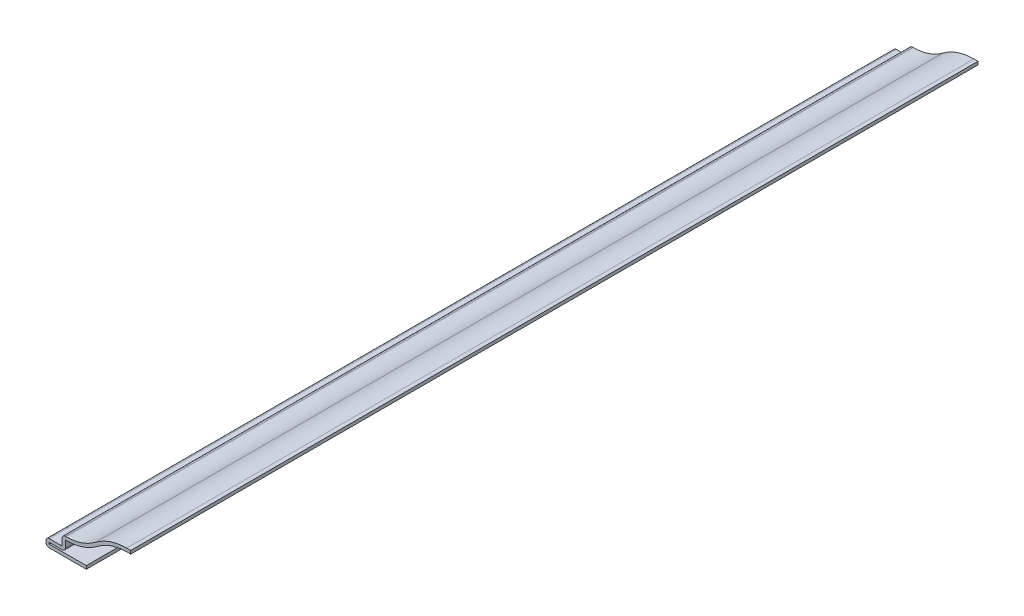
ISO-10303-21;
HEADER;
FILE_DESCRIPTION(('STEP AP214'),'2;1');
FILE_NAME('part.step','',(''),(''),'','','');
FILE_SCHEMA(('AUTOMOTIVE_DESIGN { 1 0 10303 214 1 1 1 1 }'));
ENDSEC;
DATA;
#1=APPLICATION_CONTEXT('core data for automotive mechanical design processes');
#2=APPLICATION_PROTOCOL_DEFINITION('international standard','automotive_design',2000,#1);
#3=PRODUCT_CONTEXT('',#1,'mechanical');
#4=PRODUCT('Part','Part','',(#3));
#5=PRODUCT_RELATED_PRODUCT_CATEGORY('part','',(#4));
#6=PRODUCT_DEFINITION_FORMATION('','',#4);
#7=PRODUCT_DEFINITION_CONTEXT('part definition',#1,'design');
#8=PRODUCT_DEFINITION('design','',#6,#7);
#9=PRODUCT_DEFINITION_SHAPE('','',#8);
#10=(LENGTH_UNIT() NAMED_UNIT(*) SI_UNIT(.MILLI.,.METRE.));
#11=(NAMED_UNIT(*) PLANE_ANGLE_UNIT() SI_UNIT($,.RADIAN.));
#12=(NAMED_UNIT(*) SI_UNIT($,.STERADIAN.) SOLID_ANGLE_UNIT());
#13=UNCERTAINTY_MEASURE_WITH_UNIT(LENGTH_MEASURE(1.E-05),#10,'distance_accuracy_value','');
#14=(GEOMETRIC_REPRESENTATION_CONTEXT(3) GLOBAL_UNCERTAINTY_ASSIGNED_CONTEXT((#13)) GLOBAL_UNIT_ASSIGNED_CONTEXT((#10,
#11,#12)) REPRESENTATION_CONTEXT('',''));
#15=CARTESIAN_POINT('',(0.,0.,0.));
#16=DIRECTION('',(0.,0.,1.));
#17=DIRECTION('',(1.,0.,0.));
#18=AXIS2_PLACEMENT_3D('',#15,#16,#17);
#19=CARTESIAN_POINT('',(-33.3375,0.,-333.375));
#20=DIRECTION('',(0.,-1.,0.));
#21=DIRECTION('',(1.,0.,0.));
#22=AXIS2_PLACEMENT_3D('',#19,#20,#21);
#23=PLANE('',#22);
#24=DIRECTION('',(1.,0.,0.));
#25=VECTOR('',#24,1.);
#26=CARTESIAN_POINT('',(-33.3375,0.,0.));
#27=LINE('',#26,#25);
#28=CARTESIAN_POINT('',(-32.0675,0.,0.));
#29=VERTEX_POINT('',#28);
#30=CARTESIAN_POINT('',(-17.4625,0.,0.));
#31=VERTEX_POINT('',#30);
#32=EDGE_CURVE('E315',#29,#31,#27,.T.);
#33=ORIENTED_EDGE('',*,*,#32,.F.);
#34=DIRECTION('',(0.,0.,1.));
#35=VECTOR('',#34,1.);
#36=CARTESIAN_POINT('',(-32.0675,0.,-333.375));
#37=LINE('',#36,#35);
#38=CARTESIAN_POINT('',(-32.0675,0.,-333.375));
#39=VERTEX_POINT('',#38);
#40=EDGE_CURVE('E191',#29,#39,#37,.F.);
#41=ORIENTED_EDGE('',*,*,#40,.T.);
#42=DIRECTION('',(1.,0.,0.));
#43=VECTOR('',#42,1.);
#44=CARTESIAN_POINT('',(-33.3375,0.,-333.375));
#45=LINE('',#44,#43);
#46=CARTESIAN_POINT('',(-17.4625,0.,-333.375));
#47=VERTEX_POINT('',#46);
#48=EDGE_CURVE('E184',#39,#47,#45,.T.);
#49=ORIENTED_EDGE('',*,*,#48,.T.);
#50=DIRECTION('',(0.,0.,1.));
#51=VECTOR('',#50,1.);
#52=CARTESIAN_POINT('',(-17.4625,0.,-333.375));
#53=LINE('',#52,#51);
#54=EDGE_CURVE('E188',#47,#31,#53,.T.);
#55=ORIENTED_EDGE('',*,*,#54,.T.);
#56=EDGE_LOOP('',(#33,#41,#49,#55));
#57=FACE_BOUND('',#56,.T.);
#58=ADVANCED_FACE('F35',(#57),#23,.T.);
#59=CARTESIAN_POINT('',(-33.3375,3.175,-333.375));
#60=DIRECTION('',(-1.,0.,0.));
#61=DIRECTION('',(0.,-1.,0.));
#62=AXIS2_PLACEMENT_3D('',#59,#60,#61);
#63=PLANE('',#62);
#64=DIRECTION('',(0.,-1.,0.));
#65=VECTOR('',#64,1.);
#66=CARTESIAN_POINT('',(-33.3375,3.175,-333.375));
#67=LINE('',#66,#65);
#68=CARTESIAN_POINT('',(-33.3375,1.905,-333.375));
#69=VERTEX_POINT('',#68);
#70=CARTESIAN_POINT('',(-33.3375,1.27,-333.375));
#71=VERTEX_POINT('',#70);
#72=EDGE_CURVE('E209',#69,#71,#67,.T.);
#73=ORIENTED_EDGE('',*,*,#72,.T.);
#74=DIRECTION('',(0.,0.,1.));
#75=VECTOR('',#74,1.);
#76=CARTESIAN_POINT('',(-33.3375,1.27,-333.375));
#77=LINE('',#76,#75);
#78=CARTESIAN_POINT('',(-33.3375,1.27,0.));
#79=VERTEX_POINT('',#78);
#80=EDGE_CURVE('E241',#71,#79,#77,.T.);
#81=ORIENTED_EDGE('',*,*,#80,.T.);
#82=DIRECTION('',(0.,-1.,0.));
#83=VECTOR('',#82,1.);
#84=CARTESIAN_POINT('',(-33.3375,3.175,0.));
#85=LINE('',#84,#83);
#86=CARTESIAN_POINT('',(-33.3375,1.905,0.));
#87=VERTEX_POINT('',#86);
#88=EDGE_CURVE('E194',#87,#79,#85,.T.);
#89=ORIENTED_EDGE('',*,*,#88,.F.);
#90=DIRECTION('',(0.,0.,1.));
#91=VECTOR('',#90,1.);
#92=CARTESIAN_POINT('',(-33.3375,1.905,-333.375));
#93=LINE('',#92,#91);
#94=EDGE_CURVE('E239',#87,#69,#93,.F.);
#95=ORIENTED_EDGE('',*,*,#94,.T.);
#96=EDGE_LOOP('',(#73,#81,#89,#95));
#97=FACE_BOUND('',#96,.T.);
#98=ADVANCED_FACE('F361',(#97),#63,.T.);
#99=CARTESIAN_POINT('',(-26.9875,3.175,-333.375));
#100=DIRECTION('',(0.,1.,0.));
#101=DIRECTION('',(-1.,0.,0.));
#102=AXIS2_PLACEMENT_3D('',#99,#100,#101);
#103=PLANE('',#102);
#104=DIRECTION('',(-1.,0.,0.));
#105=VECTOR('',#104,1.);
#106=CARTESIAN_POINT('',(-26.9875,3.175,-333.375));
#107=LINE('',#106,#105);
#108=CARTESIAN_POINT('',(-26.9875,3.175,-333.375));
#109=VERTEX_POINT('',#108);
#110=CARTESIAN_POINT('',(-32.0675,3.175,-333.375));
#111=VERTEX_POINT('',#110);
#112=EDGE_CURVE('E214',#109,#111,#107,.T.);
#113=ORIENTED_EDGE('',*,*,#112,.T.);
#114=DIRECTION('',(0.,0.,1.));
#115=VECTOR('',#114,1.);
#116=CARTESIAN_POINT('',(-32.0675,3.175,-333.375));
#117=LINE('',#116,#115);
#118=CARTESIAN_POINT('',(-32.0675,3.175,0.));
#119=VERTEX_POINT('',#118);
#120=EDGE_CURVE('E245',#111,#119,#117,.T.);
#121=ORIENTED_EDGE('',*,*,#120,.T.);
#122=DIRECTION('',(-1.,0.,0.));
#123=VECTOR('',#122,1.);
#124=CARTESIAN_POINT('',(-26.9875,3.175,0.));
#125=LINE('',#124,#123);
#126=CARTESIAN_POINT('',(-26.9875,3.175,0.));
#127=VERTEX_POINT('',#126);
#128=EDGE_CURVE('E265',#127,#119,#125,.T.);
#129=ORIENTED_EDGE('',*,*,#128,.F.);
#130=DIRECTION('',(0.,0.,1.));
#131=VECTOR('',#130,1.);
#132=CARTESIAN_POINT('',(-26.9875,3.175,-333.375));
#133=LINE('',#132,#131);
#134=EDGE_CURVE('E222',#109,#127,#133,.T.);
#135=ORIENTED_EDGE('',*,*,#134,.F.);
#136=EDGE_LOOP('',(#113,#121,#129,#135));
#137=FACE_BOUND('',#136,.T.);
#138=ADVANCED_FACE('F370',(#137),#103,.T.);
#139=CARTESIAN_POINT('',(-26.9875,7.12248880714343,-333.375));
#140=DIRECTION('',(-1.,0.,0.));
#141=DIRECTION('',(0.,0.,1.));
#142=AXIS2_PLACEMENT_3D('',#139,#140,#141);
#143=PLANE('',#142);
#144=DIRECTION('',(0.,-1.,0.));
#145=VECTOR('',#144,1.);
#146=CARTESIAN_POINT('',(-26.9875,7.12248880714343,0.));
#147=LINE('',#146,#145);
#148=CARTESIAN_POINT('',(-26.9875,5.85248880714343,0.));
#149=VERTEX_POINT('',#148);
#150=EDGE_CURVE('E263',#149,#127,#147,.T.);
#151=ORIENTED_EDGE('',*,*,#150,.F.);
#152=DIRECTION('',(0.,0.,1.));
#153=VECTOR('',#152,1.);
#154=CARTESIAN_POINT('',(-26.9875,5.85248880714343,-333.375));
#155=LINE('',#154,#153);
#156=CARTESIAN_POINT('',(-26.9875,5.85248880714343,-333.375));
#157=VERTEX_POINT('',#156);
#158=EDGE_CURVE('E11',#149,#157,#155,.F.);
#159=ORIENTED_EDGE('',*,*,#158,.T.);
#160=DIRECTION('',(0.,-1.,0.));
#161=VECTOR('',#160,1.);
#162=CARTESIAN_POINT('',(-26.9875,7.12248880714343,-333.375));
#163=LINE('',#162,#161);
#164=EDGE_CURVE('E348',#157,#109,#163,.T.);
#165=ORIENTED_EDGE('',*,*,#164,.T.);
#166=ORIENTED_EDGE('',*,*,#134,.T.);
#167=EDGE_LOOP('',(#151,#159,#165,#166));
#168=FACE_BOUND('',#167,.T.);
#169=ADVANCED_FACE('F372',(#168),#143,.T.);
#170=CARTESIAN_POINT('',(-26.9875,7.12248880714343,-333.375));
#171=DIRECTION('',(0.,1.,0.));
#172=DIRECTION('',(-1.,0.,0.));
#173=AXIS2_PLACEMENT_3D('',#170,#171,#172);
#174=PLANE('',#173);
#175=DIRECTION('',(-1.,0.,0.));
#176=VECTOR('',#175,1.);
#177=CARTESIAN_POINT('',(-26.9875,7.12248880714343,-333.375));
#178=LINE('',#177,#176);
#179=CARTESIAN_POINT('',(-25.4,7.12248880714343,-333.375));
#180=VERTEX_POINT('',#179);
#181=CARTESIAN_POINT('',(-25.7175,7.12248880714343,-333.375));
#182=VERTEX_POINT('',#181);
#183=EDGE_CURVE('E255',#180,#182,#178,.T.);
#184=ORIENTED_EDGE('',*,*,#183,.T.);
#185=DIRECTION('',(0.,0.,1.));
#186=VECTOR('',#185,1.);
#187=CARTESIAN_POINT('',(-25.7175,7.12248880714343,-333.375));
#188=LINE('',#187,#186);
#189=CARTESIAN_POINT('',(-25.7175,7.12248880714343,0.));
#190=VERTEX_POINT('',#189);
#191=EDGE_CURVE('E43',#182,#190,#188,.T.);
#192=ORIENTED_EDGE('',*,*,#191,.T.);
#193=DIRECTION('',(-1.,0.,0.));
#194=VECTOR('',#193,1.);
#195=CARTESIAN_POINT('',(-26.9875,7.12248880714343,0.));
#196=LINE('',#195,#194);
#197=CARTESIAN_POINT('',(-25.4,7.12248880714343,0.));
#198=VERTEX_POINT('',#197);
#199=EDGE_CURVE('E253',#198,#190,#196,.T.);
#200=ORIENTED_EDGE('',*,*,#199,.F.);
#201=DIRECTION('',(0.,0.,1.));
#202=VECTOR('',#201,1.);
#203=CARTESIAN_POINT('',(-25.4,7.12248880714343,-333.375));
#204=LINE('',#203,#202);
#205=EDGE_CURVE('E277',#180,#198,#204,.T.);
#206=ORIENTED_EDGE('',*,*,#205,.F.);
#207=EDGE_LOOP('',(#184,#192,#200,#206));
#208=FACE_BOUND('',#207,.T.);
#209=ADVANCED_FACE('F252',(#208),#174,.T.);
#210=CARTESIAN_POINT('',(-25.4,26.1724888071434,-333.375));
#211=DIRECTION('',(0.,0.,1.));
#212=DIRECTION('',(1.,0.,0.));
#213=AXIS2_PLACEMENT_3D('',#210,#211,#212);
#214=CYLINDRICAL_SURFACE('',#213,19.05);
#215=CARTESIAN_POINT('',(-25.4,26.1724888071434,0.));
#216=DIRECTION('',(0.,0.,-1.));
#217=DIRECTION('',(1.,0.,0.));
#218=AXIS2_PLACEMENT_3D('',#215,#216,#217);
#219=CIRCLE('',#218,19.05);
#220=CARTESIAN_POINT('',(-13.8545454545455,11.0197669612557,0.));
#221=VERTEX_POINT('',#220);
#222=EDGE_CURVE('E262',#221,#198,#219,.T.);
#223=ORIENTED_EDGE('',*,*,#222,.F.);
#224=DIRECTION('',(0.,0.,1.));
#225=VECTOR('',#224,1.);
#226=CARTESIAN_POINT('',(-13.8545454545455,11.0197669612557,-333.375));
#227=LINE('',#226,#225);
#228=CARTESIAN_POINT('',(-13.8545454545455,11.0197669612557,-333.375));
#229=VERTEX_POINT('',#228);
#230=EDGE_CURVE('E279',#229,#221,#227,.T.);
#231=ORIENTED_EDGE('',*,*,#230,.F.);
#232=CARTESIAN_POINT('',(-25.4,26.1724888071434,-333.375));
#233=DIRECTION('',(0.,0.,-1.));
#234=DIRECTION('',(1.,0.,0.));
#235=AXIS2_PLACEMENT_3D('',#232,#233,#234);
#236=CIRCLE('',#235,19.05);
#237=EDGE_CURVE('E347',#229,#180,#236,.T.);
#238=ORIENTED_EDGE('',*,*,#237,.T.);
#239=ORIENTED_EDGE('',*,*,#205,.T.);
#240=EDGE_LOOP('',(#223,#231,#238,#239));
#241=FACE_BOUND('',#240,.T.);
#242=ADVANCED_FACE('F346',(#241),#214,.F.);
#243=CARTESIAN_POINT('',(-1.58749999999999,-5.07999999999999,-333.375));
#244=DIRECTION('',(0.,0.,1.));
#245=DIRECTION('',(1.,0.,0.));
#246=AXIS2_PLACEMENT_3D('',#243,#244,#245);
#247=CYLINDRICAL_SURFACE('',#246,20.240625);
#248=CARTESIAN_POINT('',(-1.58749999999999,-5.07999999999999,0.));
#249=DIRECTION('',(0.,0.,1.));
#250=DIRECTION('',(1.,0.,0.));
#251=AXIS2_PLACEMENT_3D('',#248,#249,#250);
#252=CIRCLE('',#251,20.240625);
#253=CARTESIAN_POINT('',(-1.5875,15.160625,0.));
#254=VERTEX_POINT('',#253);
#255=EDGE_CURVE('E267',#254,#221,#252,.T.);
#256=ORIENTED_EDGE('',*,*,#255,.F.);
#257=DIRECTION('',(0.,0.,1.));
#258=VECTOR('',#257,1.);
#259=CARTESIAN_POINT('',(-1.5875,15.160625,-333.375));
#260=LINE('',#259,#258);
#261=CARTESIAN_POINT('',(-1.5875,15.160625,-333.375));
#262=VERTEX_POINT('',#261);
#263=EDGE_CURVE('E281',#262,#254,#260,.T.);
#264=ORIENTED_EDGE('',*,*,#263,.F.);
#265=CARTESIAN_POINT('',(-1.58749999999999,-5.07999999999999,-333.375));
#266=DIRECTION('',(0.,0.,1.));
#267=DIRECTION('',(1.,0.,0.));
#268=AXIS2_PLACEMENT_3D('',#265,#266,#267);
#269=CIRCLE('',#268,20.240625);
#270=EDGE_CURVE('E342',#262,#229,#269,.T.);
#271=ORIENTED_EDGE('',*,*,#270,.T.);
#272=ORIENTED_EDGE('',*,*,#230,.T.);
#273=EDGE_LOOP('',(#256,#264,#271,#272));
#274=FACE_BOUND('',#273,.T.);
#275=ADVANCED_FACE('F339',(#274),#247,.T.);
#276=CARTESIAN_POINT('',(0.,15.160625,-333.375));
#277=DIRECTION('',(0.,1.,0.));
#278=DIRECTION('',(0.,0.,1.));
#279=AXIS2_PLACEMENT_3D('',#276,#277,#278);
#280=PLANE('',#279);
#281=DIRECTION('',(-1.,0.,0.));
#282=VECTOR('',#281,1.);
#283=CARTESIAN_POINT('',(0.,15.160625,0.));
#284=LINE('',#283,#282);
#285=CARTESIAN_POINT('',(0.,15.160625,0.));
#286=VERTEX_POINT('',#285);
#287=EDGE_CURVE('E333',#286,#254,#284,.T.);
#288=ORIENTED_EDGE('',*,*,#287,.F.);
#289=DIRECTION('',(0.,0.,1.));
#290=VECTOR('',#289,1.);
#291=CARTESIAN_POINT('',(0.,15.160625,-333.375));
#292=LINE('',#291,#290);
#293=CARTESIAN_POINT('',(0.,15.160625,-333.375));
#294=VERTEX_POINT('',#293);
#295=EDGE_CURVE('E283',#294,#286,#292,.T.);
#296=ORIENTED_EDGE('',*,*,#295,.F.);
#297=DIRECTION('',(-1.,0.,0.));
#298=VECTOR('',#297,1.);
#299=CARTESIAN_POINT('',(0.,15.160625,-333.375));
#300=LINE('',#299,#298);
#301=EDGE_CURVE('E587',#294,#262,#300,.T.);
#302=ORIENTED_EDGE('',*,*,#301,.T.);
#303=ORIENTED_EDGE('',*,*,#263,.T.);
#304=EDGE_LOOP('',(#288,#296,#302,#303));
#305=FACE_BOUND('',#304,.T.);
#306=ADVANCED_FACE('F510',(#305),#280,.T.);
#307=CARTESIAN_POINT('',(0.,15.160625,-333.375));
#308=DIRECTION('',(-1.,0.,0.));
#309=DIRECTION('',(0.,0.,1.));
#310=AXIS2_PLACEMENT_3D('',#307,#308,#309);
#311=PLANE('',#310);
#312=DIRECTION('',(0.,-1.,0.));
#313=VECTOR('',#312,1.);
#314=CARTESIAN_POINT('',(0.,15.160625,0.));
#315=LINE('',#314,#313);
#316=CARTESIAN_POINT('',(0.,13.890625,0.));
#317=VERTEX_POINT('',#316);
#318=EDGE_CURVE('E331',#286,#317,#315,.T.);
#319=ORIENTED_EDGE('',*,*,#318,.T.);
#320=DIRECTION('',(0.,0.,1.));
#321=VECTOR('',#320,1.);
#322=CARTESIAN_POINT('',(0.,13.890625,-333.375));
#323=LINE('',#322,#321);
#324=CARTESIAN_POINT('',(0.,13.890625,-333.375));
#325=VERTEX_POINT('',#324);
#326=EDGE_CURVE('E285',#325,#317,#323,.T.);
#327=ORIENTED_EDGE('',*,*,#326,.F.);
#328=DIRECTION('',(0.,-1.,0.));
#329=VECTOR('',#328,1.);
#330=CARTESIAN_POINT('',(0.,15.160625,-333.375));
#331=LINE('',#330,#329);
#332=EDGE_CURVE('E588',#294,#325,#331,.T.);
#333=ORIENTED_EDGE('',*,*,#332,.F.);
#334=ORIENTED_EDGE('',*,*,#295,.T.);
#335=EDGE_LOOP('',(#319,#327,#333,#334));
#336=FACE_BOUND('',#335,.T.);
#337=ADVANCED_FACE('F501',(#336),#311,.F.);
#338=CARTESIAN_POINT('',(0.,13.890625,-333.375));
#339=DIRECTION('',(0.,1.,0.));
#340=DIRECTION('',(0.,0.,1.));
#341=AXIS2_PLACEMENT_3D('',#338,#339,#340);
#342=PLANE('',#341);
#343=DIRECTION('',(1.,0.,0.));
#344=VECTOR('',#343,1.);
#345=CARTESIAN_POINT('',(0.,13.890625,0.));
#346=LINE('',#345,#344);
#347=CARTESIAN_POINT('',(-1.5875,13.890625,0.));
#348=VERTEX_POINT('',#347);
#349=EDGE_CURVE('E329',#317,#348,#346,.F.);
#350=ORIENTED_EDGE('',*,*,#349,.T.);
#351=DIRECTION('',(0.,0.,1.));
#352=VECTOR('',#351,1.);
#353=CARTESIAN_POINT('',(-1.5875,13.890625,-333.375));
#354=LINE('',#353,#352);
#355=CARTESIAN_POINT('',(-1.5875,13.890625,-333.375));
#356=VERTEX_POINT('',#355);
#357=EDGE_CURVE('E288',#356,#348,#354,.T.);
#358=ORIENTED_EDGE('',*,*,#357,.F.);
#359=DIRECTION('',(1.,0.,0.));
#360=VECTOR('',#359,1.);
#361=CARTESIAN_POINT('',(0.,13.890625,-333.375));
#362=LINE('',#361,#360);
#363=EDGE_CURVE('E590',#325,#356,#362,.F.);
#364=ORIENTED_EDGE('',*,*,#363,.F.);
#365=ORIENTED_EDGE('',*,*,#326,.T.);
#366=EDGE_LOOP('',(#350,#358,#364,#365));
#367=FACE_BOUND('',#366,.T.);
#368=ADVANCED_FACE('F492',(#367),#342,.F.);
#369=CARTESIAN_POINT('',(-1.58749999999999,-5.07999999999999,-333.375));
#370=DIRECTION('',(0.,0.,1.));
#371=DIRECTION('',(1.,0.,0.));
#372=AXIS2_PLACEMENT_3D('',#369,#370,#371);
#373=CYLINDRICAL_SURFACE('',#372,18.970625);
#374=CARTESIAN_POINT('',(-1.58749999999999,-5.07999999999999,0.));
#375=DIRECTION('',(0.,0.,1.));
#376=DIRECTION('',(1.,0.,0.));
#377=AXIS2_PLACEMENT_3D('',#374,#375,#376);
#378=CIRCLE('',#377,18.970625);
#379=CARTESIAN_POINT('',(-13.0848484848485,10.0095855048632,0.));
#380=VERTEX_POINT('',#379);
#381=EDGE_CURVE('E327',#348,#380,#378,.T.);
#382=ORIENTED_EDGE('',*,*,#381,.T.);
#383=DIRECTION('',(0.,0.,1.));
#384=VECTOR('',#383,1.);
#385=CARTESIAN_POINT('',(-13.0848484848485,10.0095855048632,-333.375));
#386=LINE('',#385,#384);
#387=CARTESIAN_POINT('',(-13.0848484848485,10.0095855048632,-333.375));
#388=VERTEX_POINT('',#387);
#389=EDGE_CURVE('E291',#388,#380,#386,.T.);
#390=ORIENTED_EDGE('',*,*,#389,.F.);
#391=CARTESIAN_POINT('',(-1.58749999999999,-5.07999999999999,-333.375));
#392=DIRECTION('',(0.,0.,1.));
#393=DIRECTION('',(1.,0.,0.));
#394=AXIS2_PLACEMENT_3D('',#391,#392,#393);
#395=CIRCLE('',#394,18.970625);
#396=EDGE_CURVE('E594',#356,#388,#395,.T.);
#397=ORIENTED_EDGE('',*,*,#396,.F.);
#398=ORIENTED_EDGE('',*,*,#357,.T.);
#399=EDGE_LOOP('',(#382,#390,#397,#398));
#400=FACE_BOUND('',#399,.T.);
#401=ADVANCED_FACE('F483',(#400),#373,.F.);
#402=CARTESIAN_POINT('',(-25.4,26.1724888071434,-333.375));
#403=DIRECTION('',(0.,0.,1.));
#404=DIRECTION('',(1.,0.,0.));
#405=AXIS2_PLACEMENT_3D('',#402,#403,#404);
#406=CYLINDRICAL_SURFACE('',#405,20.32);
#407=CARTESIAN_POINT('',(-25.4,26.1724888071434,0.));
#408=DIRECTION('',(0.,0.,1.));
#409=DIRECTION('',(1.,0.,0.));
#410=AXIS2_PLACEMENT_3D('',#407,#408,#409);
#411=CIRCLE('',#410,20.32);
#412=CARTESIAN_POINT('',(-25.4,5.85248880714343,0.));
#413=VERTEX_POINT('',#412);
#414=EDGE_CURVE('E325',#380,#413,#411,.F.);
#415=ORIENTED_EDGE('',*,*,#414,.T.);
#416=DIRECTION('',(0.,0.,1.));
#417=VECTOR('',#416,1.);
#418=CARTESIAN_POINT('',(-25.4,5.85248880714343,-333.375));
#419=LINE('',#418,#417);
#420=CARTESIAN_POINT('',(-25.4,5.85248880714343,-333.375));
#421=VERTEX_POINT('',#420);
#422=EDGE_CURVE('E294',#421,#413,#419,.T.);
#423=ORIENTED_EDGE('',*,*,#422,.F.);
#424=CARTESIAN_POINT('',(-25.4,26.1724888071434,-333.375));
#425=DIRECTION('',(0.,0.,1.));
#426=DIRECTION('',(1.,0.,0.));
#427=AXIS2_PLACEMENT_3D('',#424,#425,#426);
#428=CIRCLE('',#427,20.32);
#429=EDGE_CURVE('E596',#388,#421,#428,.F.);
#430=ORIENTED_EDGE('',*,*,#429,.F.);
#431=ORIENTED_EDGE('',*,*,#389,.T.);
#432=EDGE_LOOP('',(#415,#423,#430,#431));
#433=FACE_BOUND('',#432,.T.);
#434=ADVANCED_FACE('F474',(#433),#406,.T.);
#435=CARTESIAN_POINT('',(-26.9875,5.85248880714343,-333.375));
#436=DIRECTION('',(0.,1.,0.));
#437=DIRECTION('',(-1.,0.,0.));
#438=AXIS2_PLACEMENT_3D('',#435,#436,#437);
#439=PLANE('',#438);
#440=DIRECTION('',(-1.,0.,0.));
#441=VECTOR('',#440,1.);
#442=CARTESIAN_POINT('',(-26.9875,5.85248880714343,0.));
#443=LINE('',#442,#441);
#444=CARTESIAN_POINT('',(-25.7175,5.85248880714343,0.));
#445=VERTEX_POINT('',#444);
#446=EDGE_CURVE('E323',#413,#445,#443,.T.);
#447=ORIENTED_EDGE('',*,*,#446,.T.);
#448=DIRECTION('',(0.,0.,1.));
#449=VECTOR('',#448,1.);
#450=CARTESIAN_POINT('',(-25.7175,5.85248880714343,-333.375));
#451=LINE('',#450,#449);
#452=CARTESIAN_POINT('',(-25.7175,5.85248880714343,-333.375));
#453=VERTEX_POINT('',#452);
#454=EDGE_CURVE('E297',#453,#445,#451,.T.);
#455=ORIENTED_EDGE('',*,*,#454,.F.);
#456=DIRECTION('',(-1.,0.,0.));
#457=VECTOR('',#456,1.);
#458=CARTESIAN_POINT('',(-26.9875,5.85248880714343,-333.375));
#459=LINE('',#458,#457);
#460=EDGE_CURVE('E598',#421,#453,#459,.T.);
#461=ORIENTED_EDGE('',*,*,#460,.F.);
#462=ORIENTED_EDGE('',*,*,#422,.T.);
#463=EDGE_LOOP('',(#447,#455,#461,#462));
#464=FACE_BOUND('',#463,.T.);
#465=ADVANCED_FACE('F465',(#464),#439,.F.);
#466=CARTESIAN_POINT('',(-25.7175,7.12248880714343,-333.375));
#467=DIRECTION('',(-1.,0.,0.));
#468=DIRECTION('',(0.,0.,1.));
#469=AXIS2_PLACEMENT_3D('',#466,#467,#468);
#470=PLANE('',#469);
#471=DIRECTION('',(0.,1.,0.));
#472=VECTOR('',#471,1.);
#473=CARTESIAN_POINT('',(-25.7175,7.12248880714343,0.));
#474=LINE('',#473,#472);
#475=CARTESIAN_POINT('',(-25.7175,3.175,0.));
#476=VERTEX_POINT('',#475);
#477=EDGE_CURVE('E320',#445,#476,#474,.F.);
#478=ORIENTED_EDGE('',*,*,#477,.T.);
#479=DIRECTION('',(0.,0.,1.));
#480=VECTOR('',#479,1.);
#481=CARTESIAN_POINT('',(-25.7175,3.175,-333.375));
#482=LINE('',#481,#480);
#483=CARTESIAN_POINT('',(-25.7175,3.175,-333.375));
#484=VERTEX_POINT('',#483);
#485=EDGE_CURVE('E230',#476,#484,#482,.F.);
#486=ORIENTED_EDGE('',*,*,#485,.T.);
#487=DIRECTION('',(0.,1.,0.));
#488=VECTOR('',#487,1.);
#489=CARTESIAN_POINT('',(-25.7175,7.12248880714343,-333.375));
#490=LINE('',#489,#488);
#491=EDGE_CURVE('E600',#453,#484,#490,.F.);
#492=ORIENTED_EDGE('',*,*,#491,.F.);
#493=ORIENTED_EDGE('',*,*,#454,.T.);
#494=EDGE_LOOP('',(#478,#486,#492,#493));
#495=FACE_BOUND('',#494,.T.);
#496=ADVANCED_FACE('F456',(#495),#470,.F.);
#497=CARTESIAN_POINT('',(-26.9875,1.905,-333.375));
#498=DIRECTION('',(0.,1.,0.));
#499=DIRECTION('',(-1.,0.,0.));
#500=AXIS2_PLACEMENT_3D('',#497,#498,#499);
#501=PLANE('',#500);
#502=DIRECTION('',(-1.,0.,0.));
#503=VECTOR('',#502,1.);
#504=CARTESIAN_POINT('',(-26.9875,1.905,-333.375));
#505=LINE('',#504,#503);
#506=CARTESIAN_POINT('',(-26.9875,1.905,-333.375));
#507=VERTEX_POINT('',#506);
#508=CARTESIAN_POINT('',(-32.0675,1.905,-333.375));
#509=VERTEX_POINT('',#508);
#510=EDGE_CURVE('E602',#507,#509,#505,.T.);
#511=ORIENTED_EDGE('',*,*,#510,.F.);
#512=DIRECTION('',(0.,0.,1.));
#513=VECTOR('',#512,1.);
#514=CARTESIAN_POINT('',(-26.9875,1.905,-333.375));
#515=LINE('',#514,#513);
#516=CARTESIAN_POINT('',(-26.9875,1.905,0.));
#517=VERTEX_POINT('',#516);
#518=EDGE_CURVE('E218',#507,#517,#515,.T.);
#519=ORIENTED_EDGE('',*,*,#518,.T.);
#520=DIRECTION('',(-1.,0.,0.));
#521=VECTOR('',#520,1.);
#522=CARTESIAN_POINT('',(-26.9875,1.905,0.));
#523=LINE('',#522,#521);
#524=CARTESIAN_POINT('',(-32.0675,1.905,0.));
#525=VERTEX_POINT('',#524);
#526=EDGE_CURVE('E313',#517,#525,#523,.T.);
#527=ORIENTED_EDGE('',*,*,#526,.T.);
#528=DIRECTION('',(0.,0.,1.));
#529=VECTOR('',#528,1.);
#530=CARTESIAN_POINT('',(-32.0675,1.905,-333.375));
#531=LINE('',#530,#529);
#532=EDGE_CURVE('E300',#509,#525,#531,.T.);
#533=ORIENTED_EDGE('',*,*,#532,.F.);
#534=EDGE_LOOP('',(#511,#519,#527,#533));
#535=FACE_BOUND('',#534,.T.);
#536=ADVANCED_FACE('F448',(#535),#501,.F.);
#537=CARTESIAN_POINT('',(-32.0675,3.175,-333.375));
#538=DIRECTION('',(-1.,0.,0.));
#539=DIRECTION('',(0.,-1.,0.));
#540=AXIS2_PLACEMENT_3D('',#537,#538,#539);
#541=PLANE('',#540);
#542=DIRECTION('',(0.,-1.,0.));
#543=VECTOR('',#542,1.);
#544=CARTESIAN_POINT('',(-32.0675,3.175,0.));
#545=LINE('',#544,#543);
#546=CARTESIAN_POINT('',(-32.0675,1.27,0.));
#547=VERTEX_POINT('',#546);
#548=EDGE_CURVE('E311',#525,#547,#545,.T.);
#549=ORIENTED_EDGE('',*,*,#548,.T.);
#550=DIRECTION('',(0.,0.,1.));
#551=VECTOR('',#550,1.);
#552=CARTESIAN_POINT('',(-32.0675,1.27,-333.375));
#553=LINE('',#552,#551);
#554=CARTESIAN_POINT('',(-32.0675,1.27,-333.375));
#555=VERTEX_POINT('',#554);
#556=EDGE_CURVE('E211',#555,#547,#553,.T.);
#557=ORIENTED_EDGE('',*,*,#556,.F.);
#558=DIRECTION('',(0.,-1.,0.));
#559=VECTOR('',#558,1.);
#560=CARTESIAN_POINT('',(-32.0675,3.175,-333.375));
#561=LINE('',#560,#559);
#562=EDGE_CURVE('E604',#509,#555,#561,.T.);
#563=ORIENTED_EDGE('',*,*,#562,.F.);
#564=ORIENTED_EDGE('',*,*,#532,.T.);
#565=EDGE_LOOP('',(#549,#557,#563,#564));
#566=FACE_BOUND('',#565,.T.);
#567=ADVANCED_FACE('F441',(#566),#541,.F.);
#568=CARTESIAN_POINT('',(-33.3375,1.27,-333.375));
#569=DIRECTION('',(0.,-1.,0.));
#570=DIRECTION('',(1.,0.,0.));
#571=AXIS2_PLACEMENT_3D('',#568,#569,#570);
#572=PLANE('',#571);
#573=DIRECTION('',(1.,0.,0.));
#574=VECTOR('',#573,1.);
#575=CARTESIAN_POINT('',(-33.3375,1.27,0.));
#576=LINE('',#575,#574);
#577=CARTESIAN_POINT('',(-17.4625,1.27,0.));
#578=VERTEX_POINT('',#577);
#579=EDGE_CURVE('E307',#547,#578,#576,.T.);
#580=ORIENTED_EDGE('',*,*,#579,.T.);
#581=DIRECTION('',(0.,0.,1.));
#582=VECTOR('',#581,1.);
#583=CARTESIAN_POINT('',(-17.4625,1.27,-333.375));
#584=LINE('',#583,#582);
#585=CARTESIAN_POINT('',(-17.4625,1.27,-333.375));
#586=VERTEX_POINT('',#585);
#587=EDGE_CURVE('E208',#586,#578,#584,.T.);
#588=ORIENTED_EDGE('',*,*,#587,.F.);
#589=DIRECTION('',(1.,0.,0.));
#590=VECTOR('',#589,1.);
#591=CARTESIAN_POINT('',(-33.3375,1.27,-333.375));
#592=LINE('',#591,#590);
#593=EDGE_CURVE('E200',#555,#586,#592,.T.);
#594=ORIENTED_EDGE('',*,*,#593,.F.);
#595=ORIENTED_EDGE('',*,*,#556,.T.);
#596=EDGE_LOOP('',(#580,#588,#594,#595));
#597=FACE_BOUND('',#596,.T.);
#598=ADVANCED_FACE('F306',(#597),#572,.F.);
#599=CARTESIAN_POINT('',(-17.4625,1.27,-333.375));
#600=DIRECTION('',(-1.,0.,0.));
#601=DIRECTION('',(0.,0.,1.));
#602=AXIS2_PLACEMENT_3D('',#599,#600,#601);
#603=PLANE('',#602);
#604=DIRECTION('',(0.,-1.,0.));
#605=VECTOR('',#604,1.);
#606=CARTESIAN_POINT('',(-17.4625,1.27,0.));
#607=LINE('',#606,#605);
#608=EDGE_CURVE('E207',#578,#31,#607,.T.);
#609=ORIENTED_EDGE('',*,*,#608,.T.);
#610=ORIENTED_EDGE('',*,*,#54,.F.);
#611=DIRECTION('',(0.,-1.,0.));
#612=VECTOR('',#611,1.);
#613=CARTESIAN_POINT('',(-17.4625,1.27,-333.375));
#614=LINE('',#613,#612);
#615=EDGE_CURVE('E193',#586,#47,#614,.T.);
#616=ORIENTED_EDGE('',*,*,#615,.F.);
#617=ORIENTED_EDGE('',*,*,#587,.T.);
#618=EDGE_LOOP('',(#609,#610,#616,#617));
#619=FACE_BOUND('',#618,.T.);
#620=ADVANCED_FACE('F205',(#619),#603,.F.);
#621=CARTESIAN_POINT('',(-25.4,26.1724888071434,-333.375));
#622=DIRECTION('',(0.,0.,1.));
#623=DIRECTION('',(1.,0.,0.));
#624=AXIS2_PLACEMENT_3D('',#621,#622,#623);
#625=PLANE('',#624);
#626=ORIENTED_EDGE('',*,*,#491,.T.);
#627=CARTESIAN_POINT('',(-26.9875,3.175,-333.375));
#628=DIRECTION('',(0.,0.,1.));
#629=DIRECTION('',(1.,0.,0.));
#630=AXIS2_PLACEMENT_3D('',#627,#628,#629);
#631=CIRCLE('',#630,1.27);
#632=EDGE_CURVE('E237',#484,#507,#631,.F.);
#633=ORIENTED_EDGE('',*,*,#632,.T.);
#634=ORIENTED_EDGE('',*,*,#510,.T.);
#635=ORIENTED_EDGE('',*,*,#562,.T.);
#636=ORIENTED_EDGE('',*,*,#593,.T.);
#637=ORIENTED_EDGE('',*,*,#615,.T.);
#638=ORIENTED_EDGE('',*,*,#48,.F.);
#639=CARTESIAN_POINT('',(-32.0675,1.27,-333.375));
#640=DIRECTION('',(0.,0.,1.));
#641=DIRECTION('',(1.,0.,0.));
#642=AXIS2_PLACEMENT_3D('',#639,#640,#641);
#643=CIRCLE('',#642,1.27);
#644=EDGE_CURVE('E235',#39,#71,#643,.F.);
#645=ORIENTED_EDGE('',*,*,#644,.T.);
#646=ORIENTED_EDGE('',*,*,#72,.F.);
#647=CARTESIAN_POINT('',(-32.0675,1.905,-333.375));
#648=DIRECTION('',(0.,0.,1.));
#649=DIRECTION('',(1.,0.,0.));
#650=AXIS2_PLACEMENT_3D('',#647,#648,#649);
#651=CIRCLE('',#650,1.27);
#652=EDGE_CURVE('E233',#69,#111,#651,.F.);
#653=ORIENTED_EDGE('',*,*,#652,.T.);
#654=ORIENTED_EDGE('',*,*,#112,.F.);
#655=ORIENTED_EDGE('',*,*,#164,.F.);
#656=CARTESIAN_POINT('',(-25.7175,5.85248880714343,-333.375));
#657=DIRECTION('',(0.,0.,1.));
#658=DIRECTION('',(1.,0.,0.));
#659=AXIS2_PLACEMENT_3D('',#656,#657,#658);
#660=CIRCLE('',#659,1.27);
#661=EDGE_CURVE('E50',#157,#182,#660,.F.);
#662=ORIENTED_EDGE('',*,*,#661,.T.);
#663=ORIENTED_EDGE('',*,*,#183,.F.);
#664=ORIENTED_EDGE('',*,*,#237,.F.);
#665=ORIENTED_EDGE('',*,*,#270,.F.);
#666=ORIENTED_EDGE('',*,*,#301,.F.);
#667=ORIENTED_EDGE('',*,*,#332,.T.);
#668=ORIENTED_EDGE('',*,*,#363,.T.);
#669=ORIENTED_EDGE('',*,*,#396,.T.);
#670=ORIENTED_EDGE('',*,*,#429,.T.);
#671=ORIENTED_EDGE('',*,*,#460,.T.);
#672=EDGE_LOOP('',(#626,#633,#634,#635,#636,#637,#638,#645,#646,#653,#654,#655,#662,#663,#664,
#665,#666,#667,#668,#669,#670,#671));
#673=FACE_BOUND('',#672,.T.);
#674=ADVANCED_FACE('F198',(#673),#625,.F.);
#675=CARTESIAN_POINT('',(-25.4,26.1724888071434,0.));
#676=DIRECTION('',(0.,0.,1.));
#677=DIRECTION('',(1.,0.,0.));
#678=AXIS2_PLACEMENT_3D('',#675,#676,#677);
#679=PLANE('',#678);
#680=ORIENTED_EDGE('',*,*,#526,.F.);
#681=CARTESIAN_POINT('',(-26.9875,3.175,0.));
#682=DIRECTION('',(0.,0.,1.));
#683=DIRECTION('',(1.,0.,0.));
#684=AXIS2_PLACEMENT_3D('',#681,#682,#683);
#685=CIRCLE('',#684,1.27);
#686=EDGE_CURVE('E228',#517,#476,#685,.T.);
#687=ORIENTED_EDGE('',*,*,#686,.T.);
#688=ORIENTED_EDGE('',*,*,#477,.F.);
#689=ORIENTED_EDGE('',*,*,#446,.F.);
#690=ORIENTED_EDGE('',*,*,#414,.F.);
#691=ORIENTED_EDGE('',*,*,#381,.F.);
#692=ORIENTED_EDGE('',*,*,#349,.F.);
#693=ORIENTED_EDGE('',*,*,#318,.F.);
#694=ORIENTED_EDGE('',*,*,#287,.T.);
#695=ORIENTED_EDGE('',*,*,#255,.T.);
#696=ORIENTED_EDGE('',*,*,#222,.T.);
#697=ORIENTED_EDGE('',*,*,#199,.T.);
#698=CARTESIAN_POINT('',(-25.7175,5.85248880714343,0.));
#699=DIRECTION('',(0.,0.,1.));
#700=DIRECTION('',(1.,0.,0.));
#701=AXIS2_PLACEMENT_3D('',#698,#699,#700);
#702=CIRCLE('',#701,1.27);
#703=EDGE_CURVE('E221',#190,#149,#702,.T.);
#704=ORIENTED_EDGE('',*,*,#703,.T.);
#705=ORIENTED_EDGE('',*,*,#150,.T.);
#706=ORIENTED_EDGE('',*,*,#128,.T.);
#707=CARTESIAN_POINT('',(-32.0675,1.905,0.));
#708=DIRECTION('',(0.,0.,1.));
#709=DIRECTION('',(1.,0.,0.));
#710=AXIS2_PLACEMENT_3D('',#707,#708,#709);
#711=CIRCLE('',#710,1.27);
#712=EDGE_CURVE('E224',#119,#87,#711,.T.);
#713=ORIENTED_EDGE('',*,*,#712,.T.);
#714=ORIENTED_EDGE('',*,*,#88,.T.);
#715=CARTESIAN_POINT('',(-32.0675,1.27,0.));
#716=DIRECTION('',(0.,0.,1.));
#717=DIRECTION('',(1.,0.,0.));
#718=AXIS2_PLACEMENT_3D('',#715,#716,#717);
#719=CIRCLE('',#718,1.27);
#720=EDGE_CURVE('E226',#79,#29,#719,.T.);
#721=ORIENTED_EDGE('',*,*,#720,.T.);
#722=ORIENTED_EDGE('',*,*,#32,.T.);
#723=ORIENTED_EDGE('',*,*,#608,.F.);
#724=ORIENTED_EDGE('',*,*,#579,.F.);
#725=ORIENTED_EDGE('',*,*,#548,.F.);
#726=EDGE_LOOP('',(#680,#687,#688,#689,#690,#691,#692,#693,#694,#695,#696,#697,#704,#705,#706,
#713,#714,#721,#722,#723,#724,#725));
#727=FACE_BOUND('',#726,.T.);
#728=ADVANCED_FACE('F259',(#727),#679,.T.);
#729=CARTESIAN_POINT('',(-26.9875,3.175,-333.375));
#730=DIRECTION('',(0.,0.,1.));
#731=DIRECTION('',(1.,0.,0.));
#732=AXIS2_PLACEMENT_3D('',#729,#730,#731);
#733=CYLINDRICAL_SURFACE('',#732,1.27);
#734=ORIENTED_EDGE('',*,*,#632,.F.);
#735=ORIENTED_EDGE('',*,*,#485,.F.);
#736=ORIENTED_EDGE('',*,*,#686,.F.);
#737=ORIENTED_EDGE('',*,*,#518,.F.);
#738=EDGE_LOOP('',(#734,#735,#736,#737));
#739=FACE_BOUND('',#738,.T.);
#740=ADVANCED_FACE('F386',(#739),#733,.T.);
#741=CARTESIAN_POINT('',(-32.0675,1.27,-333.375));
#742=DIRECTION('',(0.,0.,1.));
#743=DIRECTION('',(1.,0.,0.));
#744=AXIS2_PLACEMENT_3D('',#741,#742,#743);
#745=CYLINDRICAL_SURFACE('',#744,1.27);
#746=ORIENTED_EDGE('',*,*,#644,.F.);
#747=ORIENTED_EDGE('',*,*,#40,.F.);
#748=ORIENTED_EDGE('',*,*,#720,.F.);
#749=ORIENTED_EDGE('',*,*,#80,.F.);
#750=EDGE_LOOP('',(#746,#747,#748,#749));
#751=FACE_BOUND('',#750,.T.);
#752=ADVANCED_FACE('F356',(#751),#745,.T.);
#753=CARTESIAN_POINT('',(-32.0675,1.905,-333.375));
#754=DIRECTION('',(0.,0.,1.));
#755=DIRECTION('',(1.,0.,0.));
#756=AXIS2_PLACEMENT_3D('',#753,#754,#755);
#757=CYLINDRICAL_SURFACE('',#756,1.27);
#758=ORIENTED_EDGE('',*,*,#652,.F.);
#759=ORIENTED_EDGE('',*,*,#94,.F.);
#760=ORIENTED_EDGE('',*,*,#712,.F.);
#761=ORIENTED_EDGE('',*,*,#120,.F.);
#762=EDGE_LOOP('',(#758,#759,#760,#761));
#763=FACE_BOUND('',#762,.T.);
#764=ADVANCED_FACE('F365',(#763),#757,.T.);
#765=CARTESIAN_POINT('',(-25.7175,5.85248880714343,-333.375));
#766=DIRECTION('',(0.,0.,1.));
#767=DIRECTION('',(1.,0.,0.));
#768=AXIS2_PLACEMENT_3D('',#765,#766,#767);
#769=CYLINDRICAL_SURFACE('',#768,1.27);
#770=ORIENTED_EDGE('',*,*,#661,.F.);
#771=ORIENTED_EDGE('',*,*,#158,.F.);
#772=ORIENTED_EDGE('',*,*,#703,.F.);
#773=ORIENTED_EDGE('',*,*,#191,.F.);
#774=EDGE_LOOP('',(#770,#771,#772,#773));
#775=FACE_BOUND('',#774,.T.);
#776=ADVANCED_FACE('F37',(#775),#769,.T.);
#777=CLOSED_SHELL('',(#58,#98,#138,#169,#209,#242,#275,#306,#337,#368,#401,#434,#465,#496,#536,
#567,#598,#620,#674,#728,#740,#752,#764,#776));
#778=MANIFOLD_SOLID_BREP('B2',#777);
#779=ADVANCED_BREP_SHAPE_REPRESENTATION('',(#18,#778),#14);
#780=SHAPE_DEFINITION_REPRESENTATION(#9,#779);
ENDSEC;
END-ISO-10303-21;
